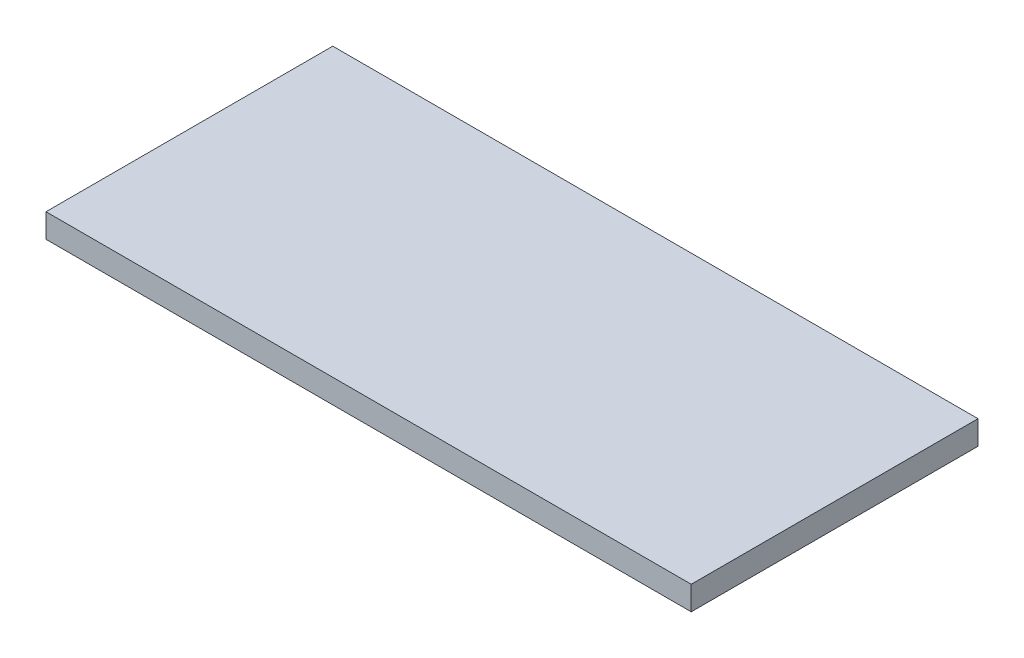
ISO-10303-21;
HEADER;
FILE_DESCRIPTION(('STEP AP214'),'2;1');
FILE_NAME('part.step','',(''),(''),'','','');
FILE_SCHEMA(('AUTOMOTIVE_DESIGN { 1 0 10303 214 1 1 1 1 }'));
ENDSEC;
DATA;
#1=APPLICATION_CONTEXT('core data for automotive mechanical design processes');
#2=APPLICATION_PROTOCOL_DEFINITION('international standard','automotive_design',2000,#1);
#3=PRODUCT_CONTEXT('',#1,'mechanical');
#4=PRODUCT('Part','Part','',(#3));
#5=PRODUCT_RELATED_PRODUCT_CATEGORY('part','',(#4));
#6=PRODUCT_DEFINITION_FORMATION('','',#4);
#7=PRODUCT_DEFINITION_CONTEXT('part definition',#1,'design');
#8=PRODUCT_DEFINITION('design','',#6,#7);
#9=PRODUCT_DEFINITION_SHAPE('','',#8);
#10=(LENGTH_UNIT() NAMED_UNIT(*) SI_UNIT(.MILLI.,.METRE.));
#11=(NAMED_UNIT(*) PLANE_ANGLE_UNIT() SI_UNIT($,.RADIAN.));
#12=(NAMED_UNIT(*) SI_UNIT($,.STERADIAN.) SOLID_ANGLE_UNIT());
#13=UNCERTAINTY_MEASURE_WITH_UNIT(LENGTH_MEASURE(1.E-05),#10,'distance_accuracy_value','');
#14=(GEOMETRIC_REPRESENTATION_CONTEXT(3) GLOBAL_UNCERTAINTY_ASSIGNED_CONTEXT((#13)) GLOBAL_UNIT_ASSIGNED_CONTEXT((#10,
#11,#12)) REPRESENTATION_CONTEXT('',''));
#15=CARTESIAN_POINT('',(0.,0.,0.));
#16=DIRECTION('',(0.,0.,1.));
#17=DIRECTION('',(1.,0.,0.));
#18=AXIS2_PLACEMENT_3D('',#15,#16,#17);
#19=CARTESIAN_POINT('',(27.,2.,12.));
#20=DIRECTION('',(-1.,0.,0.));
#21=DIRECTION('',(0.,0.,1.));
#22=AXIS2_PLACEMENT_3D('',#19,#20,#21);
#23=PLANE('',#22);
#24=DIRECTION('',(0.,0.,-1.));
#25=VECTOR('',#24,1.);
#26=CARTESIAN_POINT('',(27.,0.,12.));
#27=LINE('',#26,#25);
#28=CARTESIAN_POINT('',(27.,0.,12.));
#29=VERTEX_POINT('',#28);
#30=CARTESIAN_POINT('',(27.,0.,-12.));
#31=VERTEX_POINT('',#30);
#32=EDGE_CURVE('E96',#29,#31,#27,.T.);
#33=ORIENTED_EDGE('',*,*,#32,.T.);
#34=DIRECTION('',(0.,-1.,0.));
#35=VECTOR('',#34,1.);
#36=CARTESIAN_POINT('',(27.,2.,-12.));
#37=LINE('',#36,#35);
#38=CARTESIAN_POINT('',(27.,2.,-12.));
#39=VERTEX_POINT('',#38);
#40=EDGE_CURVE('E11',#39,#31,#37,.T.);
#41=ORIENTED_EDGE('',*,*,#40,.F.);
#42=DIRECTION('',(0.,0.,-1.));
#43=VECTOR('',#42,1.);
#44=CARTESIAN_POINT('',(27.,2.,12.));
#45=LINE('',#44,#43);
#46=CARTESIAN_POINT('',(27.,2.,12.));
#47=VERTEX_POINT('',#46);
#48=EDGE_CURVE('E84',#47,#39,#45,.T.);
#49=ORIENTED_EDGE('',*,*,#48,.F.);
#50=DIRECTION('',(0.,-1.,0.));
#51=VECTOR('',#50,1.);
#52=CARTESIAN_POINT('',(27.,2.,12.));
#53=LINE('',#52,#51);
#54=EDGE_CURVE('E92',#47,#29,#53,.T.);
#55=ORIENTED_EDGE('',*,*,#54,.T.);
#56=EDGE_LOOP('',(#33,#41,#49,#55));
#57=FACE_BOUND('',#56,.T.);
#58=ADVANCED_FACE('F33',(#57),#23,.F.);
#59=CARTESIAN_POINT('',(-27.,2.,-12.));
#60=DIRECTION('',(0.,0.,1.));
#61=DIRECTION('',(1.,0.,0.));
#62=AXIS2_PLACEMENT_3D('',#59,#60,#61);
#63=PLANE('',#62);
#64=DIRECTION('',(-1.,0.,0.));
#65=VECTOR('',#64,1.);
#66=CARTESIAN_POINT('',(-27.,0.,-12.));
#67=LINE('',#66,#65);
#68=CARTESIAN_POINT('',(-27.,0.,-12.));
#69=VERTEX_POINT('',#68);
#70=EDGE_CURVE('E88',#31,#69,#67,.T.);
#71=ORIENTED_EDGE('',*,*,#70,.T.);
#72=DIRECTION('',(0.,-1.,0.));
#73=VECTOR('',#72,1.);
#74=CARTESIAN_POINT('',(-27.,2.,-12.));
#75=LINE('',#74,#73);
#76=CARTESIAN_POINT('',(-27.,2.,-12.));
#77=VERTEX_POINT('',#76);
#78=EDGE_CURVE('E41',#77,#69,#75,.T.);
#79=ORIENTED_EDGE('',*,*,#78,.F.);
#80=DIRECTION('',(-1.,0.,0.));
#81=VECTOR('',#80,1.);
#82=CARTESIAN_POINT('',(-27.,2.,-12.));
#83=LINE('',#82,#81);
#84=EDGE_CURVE('E79',#39,#77,#83,.T.);
#85=ORIENTED_EDGE('',*,*,#84,.F.);
#86=ORIENTED_EDGE('',*,*,#40,.T.);
#87=EDGE_LOOP('',(#71,#79,#85,#86));
#88=FACE_BOUND('',#87,.T.);
#89=ADVANCED_FACE('F87',(#88),#63,.F.);
#90=CARTESIAN_POINT('',(-27.,2.,12.));
#91=DIRECTION('',(1.,0.,0.));
#92=DIRECTION('',(0.,0.,-1.));
#93=AXIS2_PLACEMENT_3D('',#90,#91,#92);
#94=PLANE('',#93);
#95=DIRECTION('',(0.,0.,1.));
#96=VECTOR('',#95,1.);
#97=CARTESIAN_POINT('',(-27.,0.,12.));
#98=LINE('',#97,#96);
#99=CARTESIAN_POINT('',(-27.,0.,12.));
#100=VERTEX_POINT('',#99);
#101=EDGE_CURVE('E66',#69,#100,#98,.T.);
#102=ORIENTED_EDGE('',*,*,#101,.T.);
#103=DIRECTION('',(0.,-1.,0.));
#104=VECTOR('',#103,1.);
#105=CARTESIAN_POINT('',(-27.,2.,12.));
#106=LINE('',#105,#104);
#107=CARTESIAN_POINT('',(-27.,2.,12.));
#108=VERTEX_POINT('',#107);
#109=EDGE_CURVE('E89',#108,#100,#106,.T.);
#110=ORIENTED_EDGE('',*,*,#109,.F.);
#111=DIRECTION('',(0.,0.,1.));
#112=VECTOR('',#111,1.);
#113=CARTESIAN_POINT('',(-27.,2.,12.));
#114=LINE('',#113,#112);
#115=EDGE_CURVE('E82',#77,#108,#114,.T.);
#116=ORIENTED_EDGE('',*,*,#115,.F.);
#117=ORIENTED_EDGE('',*,*,#78,.T.);
#118=EDGE_LOOP('',(#102,#110,#116,#117));
#119=FACE_BOUND('',#118,.T.);
#120=ADVANCED_FACE('F90',(#119),#94,.F.);
#121=CARTESIAN_POINT('',(-27.,2.,12.));
#122=DIRECTION('',(0.,0.,-1.));
#123=DIRECTION('',(-1.,0.,0.));
#124=AXIS2_PLACEMENT_3D('',#121,#122,#123);
#125=PLANE('',#124);
#126=DIRECTION('',(1.,0.,0.));
#127=VECTOR('',#126,1.);
#128=CARTESIAN_POINT('',(-27.,0.,12.));
#129=LINE('',#128,#127);
#130=EDGE_CURVE('E72',#100,#29,#129,.T.);
#131=ORIENTED_EDGE('',*,*,#130,.T.);
#132=ORIENTED_EDGE('',*,*,#54,.F.);
#133=DIRECTION('',(1.,0.,0.));
#134=VECTOR('',#133,1.);
#135=CARTESIAN_POINT('',(-27.,2.,12.));
#136=LINE('',#135,#134);
#137=EDGE_CURVE('E49',#108,#47,#136,.T.);
#138=ORIENTED_EDGE('',*,*,#137,.F.);
#139=ORIENTED_EDGE('',*,*,#109,.T.);
#140=EDGE_LOOP('',(#131,#132,#138,#139));
#141=FACE_BOUND('',#140,.T.);
#142=ADVANCED_FACE('F103',(#141),#125,.F.);
#143=CARTESIAN_POINT('',(0.,2.,0.));
#144=DIRECTION('',(0.,-1.,0.));
#145=DIRECTION('',(0.,0.,-1.));
#146=AXIS2_PLACEMENT_3D('',#143,#144,#145);
#147=PLANE('',#146);
#148=ORIENTED_EDGE('',*,*,#48,.T.);
#149=ORIENTED_EDGE('',*,*,#84,.T.);
#150=ORIENTED_EDGE('',*,*,#115,.T.);
#151=ORIENTED_EDGE('',*,*,#137,.T.);
#152=EDGE_LOOP('',(#148,#149,#150,#151));
#153=FACE_BOUND('',#152,.T.);
#154=ADVANCED_FACE('F80',(#153),#147,.F.);
#155=CARTESIAN_POINT('',(0.,0.,0.));
#156=DIRECTION('',(0.,-1.,0.));
#157=DIRECTION('',(0.,0.,-1.));
#158=AXIS2_PLACEMENT_3D('',#155,#156,#157);
#159=PLANE('',#158);
#160=ORIENTED_EDGE('',*,*,#32,.F.);
#161=ORIENTED_EDGE('',*,*,#130,.F.);
#162=ORIENTED_EDGE('',*,*,#101,.F.);
#163=ORIENTED_EDGE('',*,*,#70,.F.);
#164=EDGE_LOOP('',(#160,#161,#162,#163));
#165=FACE_BOUND('',#164,.T.);
#166=ADVANCED_FACE('F106',(#165),#159,.T.);
#167=CLOSED_SHELL('',(#58,#89,#120,#142,#154,#166));
#168=MANIFOLD_SOLID_BREP('B2',#167);
#169=ADVANCED_BREP_SHAPE_REPRESENTATION('',(#18,#168),#14);
#170=SHAPE_DEFINITION_REPRESENTATION(#9,#169);
ENDSEC;
END-ISO-10303-21;
